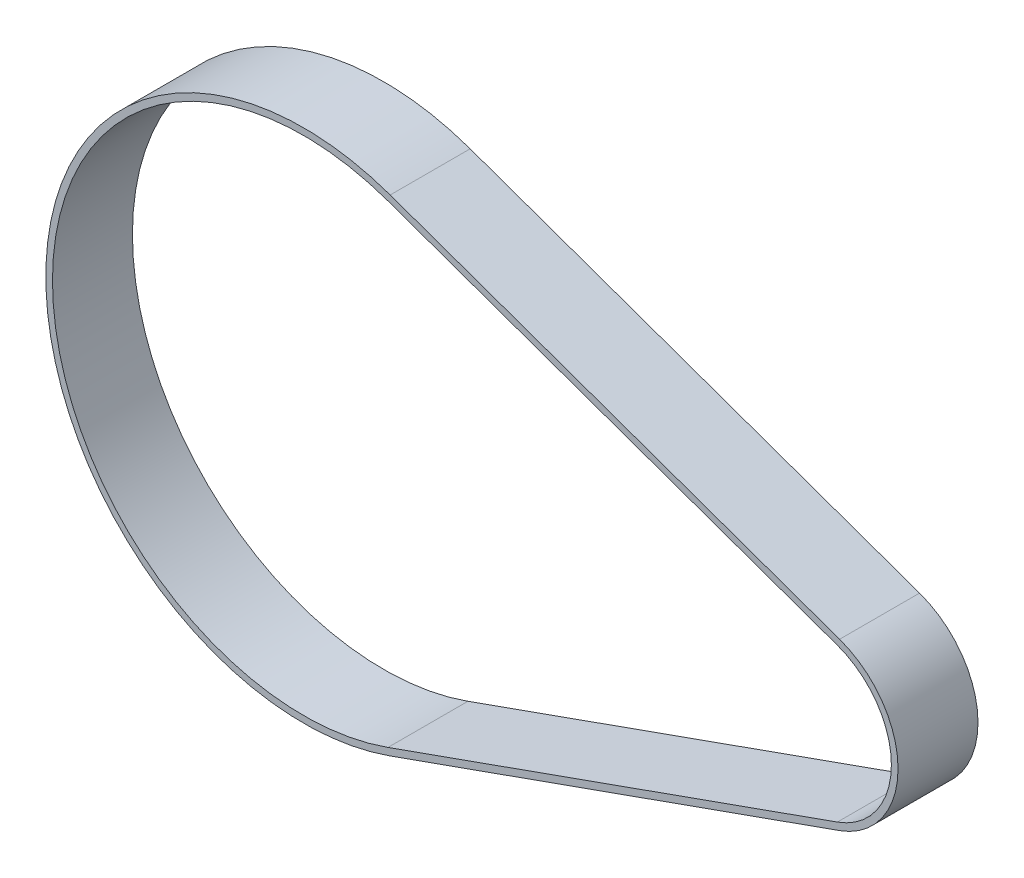
ISO-10303-21;
HEADER;
FILE_DESCRIPTION(('STEP AP214'),'2;1');
FILE_NAME('part.step','',(''),(''),'','','');
FILE_SCHEMA(('AUTOMOTIVE_DESIGN { 1 0 10303 214 1 1 1 1 }'));
ENDSEC;
DATA;
#1=APPLICATION_CONTEXT('core data for automotive mechanical design processes');
#2=APPLICATION_PROTOCOL_DEFINITION('international standard','automotive_design',2000,#1);
#3=PRODUCT_CONTEXT('',#1,'mechanical');
#4=PRODUCT('Part','Part','',(#3));
#5=PRODUCT_RELATED_PRODUCT_CATEGORY('part','',(#4));
#6=PRODUCT_DEFINITION_FORMATION('','',#4);
#7=PRODUCT_DEFINITION_CONTEXT('part definition',#1,'design');
#8=PRODUCT_DEFINITION('design','',#6,#7);
#9=PRODUCT_DEFINITION_SHAPE('','',#8);
#10=(LENGTH_UNIT() NAMED_UNIT(*) SI_UNIT(.MILLI.,.METRE.));
#11=(NAMED_UNIT(*) PLANE_ANGLE_UNIT() SI_UNIT($,.RADIAN.));
#12=(NAMED_UNIT(*) SI_UNIT($,.STERADIAN.) SOLID_ANGLE_UNIT());
#13=UNCERTAINTY_MEASURE_WITH_UNIT(LENGTH_MEASURE(1.E-05),#10,'distance_accuracy_value','');
#14=(GEOMETRIC_REPRESENTATION_CONTEXT(3) GLOBAL_UNCERTAINTY_ASSIGNED_CONTEXT((#13)) GLOBAL_UNIT_ASSIGNED_CONTEXT((#10,
#11,#12)) REPRESENTATION_CONTEXT('',''));
#15=CARTESIAN_POINT('',(0.,0.,0.));
#16=DIRECTION('',(0.,0.,1.));
#17=DIRECTION('',(1.,0.,0.));
#18=AXIS2_PLACEMENT_3D('',#15,#16,#17);
#19=CARTESIAN_POINT('',(0.,0.,6.));
#20=DIRECTION('',(0.,0.,1.));
#21=DIRECTION('',(1.,0.,0.));
#22=AXIS2_PLACEMENT_3D('',#19,#20,#21);
#23=PLANE('',#22);
#24=CARTESIAN_POINT('',(0.,0.,6.));
#25=DIRECTION('',(0.,0.,1.));
#26=DIRECTION('',(1.,0.,0.));
#27=AXIS2_PLACEMENT_3D('',#24,#25,#26);
#28=CIRCLE('',#27,19.35);
#29=CARTESIAN_POINT('',(6.49243421052632,18.2282966297454,6.));
#30=VERTEX_POINT('',#29);
#31=CARTESIAN_POINT('',(6.49243421052631,-18.2282966297454,6.));
#32=VERTEX_POINT('',#31);
#33=EDGE_CURVE('E133',#30,#32,#28,.T.);
#34=ORIENTED_EDGE('',*,*,#33,.T.);
#35=DIRECTION('',(0.942030833578574,0.335526315789474,0.));
#36=VECTOR('',#35,1.);
#37=CARTESIAN_POINT('',(40.2144736842105,-6.21740350161858,6.));
#38=LINE('',#37,#36);
#39=CARTESIAN_POINT('',(40.2144736842105,-6.21740350161858,6.));
#40=VERTEX_POINT('',#39);
#41=EDGE_CURVE('E136',#32,#40,#38,.T.);
#42=ORIENTED_EDGE('',*,*,#41,.T.);
#43=CARTESIAN_POINT('',(38.,0.,6.));
#44=DIRECTION('',(0.,0.,1.));
#45=DIRECTION('',(1.,0.,0.));
#46=AXIS2_PLACEMENT_3D('',#43,#44,#45);
#47=CIRCLE('',#46,6.6);
#48=CARTESIAN_POINT('',(40.2144736842105,6.21740350161858,6.));
#49=VERTEX_POINT('',#48);
#50=EDGE_CURVE('E139',#40,#49,#47,.T.);
#51=ORIENTED_EDGE('',*,*,#50,.T.);
#52=DIRECTION('',(-0.942030833578574,0.335526315789474,0.));
#53=VECTOR('',#52,1.);
#54=CARTESIAN_POINT('',(6.49243421052632,18.2282966297454,6.));
#55=LINE('',#54,#53);
#56=EDGE_CURVE('E141',#49,#30,#55,.T.);
#57=ORIENTED_EDGE('',*,*,#56,.T.);
#58=EDGE_LOOP('',(#34,#42,#51,#57));
#59=FACE_BOUND('',#58,.T.);
#60=DIRECTION('',(0.942030833578574,0.335526315789474,0.));
#61=VECTOR('',#60,1.);
#62=CARTESIAN_POINT('',(40.0467105263158,-5.7463880848293,6.));
#63=LINE('',#62,#61);
#64=CARTESIAN_POINT('',(6.32467105263158,-17.7572812129561,6.));
#65=VERTEX_POINT('',#64);
#66=CARTESIAN_POINT('',(40.0467105263158,-5.7463880848293,6.));
#67=VERTEX_POINT('',#66);
#68=EDGE_CURVE('E105',#65,#67,#63,.T.);
#69=ORIENTED_EDGE('',*,*,#68,.F.);
#70=CARTESIAN_POINT('',(0.,0.,6.));
#71=DIRECTION('',(0.,0.,1.));
#72=DIRECTION('',(1.,0.,0.));
#73=AXIS2_PLACEMENT_3D('',#70,#71,#72);
#74=CIRCLE('',#73,18.85);
#75=CARTESIAN_POINT('',(6.32467105263158,17.7572812129561,6.));
#76=VERTEX_POINT('',#75);
#77=EDGE_CURVE('E97',#76,#65,#74,.T.);
#78=ORIENTED_EDGE('',*,*,#77,.F.);
#79=DIRECTION('',(-0.942030833578574,0.335526315789474,0.));
#80=VECTOR('',#79,1.);
#81=CARTESIAN_POINT('',(6.32467105263158,17.7572812129561,6.));
#82=LINE('',#81,#80);
#83=CARTESIAN_POINT('',(40.0467105263158,5.7463880848293,6.));
#84=VERTEX_POINT('',#83);
#85=EDGE_CURVE('E119',#84,#76,#82,.T.);
#86=ORIENTED_EDGE('',*,*,#85,.F.);
#87=CARTESIAN_POINT('',(38.,0.,6.));
#88=DIRECTION('',(0.,0.,1.));
#89=DIRECTION('',(1.,0.,0.));
#90=AXIS2_PLACEMENT_3D('',#87,#88,#89);
#91=CIRCLE('',#90,6.1);
#92=EDGE_CURVE('E117',#67,#84,#91,.T.);
#93=ORIENTED_EDGE('',*,*,#92,.F.);
#94=EDGE_LOOP('',(#69,#78,#86,#93));
#95=FACE_BOUND('',#94,.T.);
#96=ADVANCED_FACE('F32',(#59,#95),#23,.T.);
#97=CARTESIAN_POINT('',(0.,0.,0.));
#98=DIRECTION('',(0.,0.,1.));
#99=DIRECTION('',(1.,0.,0.));
#100=AXIS2_PLACEMENT_3D('',#97,#98,#99);
#101=PLANE('',#100);
#102=CARTESIAN_POINT('',(0.,0.,0.));
#103=DIRECTION('',(0.,0.,1.));
#104=DIRECTION('',(1.,0.,0.));
#105=AXIS2_PLACEMENT_3D('',#102,#103,#104);
#106=CIRCLE('',#105,19.35);
#107=CARTESIAN_POINT('',(6.49243421052632,18.2282966297454,0.));
#108=VERTEX_POINT('',#107);
#109=CARTESIAN_POINT('',(6.49243421052631,-18.2282966297454,0.));
#110=VERTEX_POINT('',#109);
#111=EDGE_CURVE('E113',#108,#110,#106,.T.);
#112=ORIENTED_EDGE('',*,*,#111,.F.);
#113=DIRECTION('',(-0.942030833578574,0.335526315789474,0.));
#114=VECTOR('',#113,1.);
#115=CARTESIAN_POINT('',(6.49243421052632,18.2282966297454,0.));
#116=LINE('',#115,#114);
#117=CARTESIAN_POINT('',(40.2144736842105,6.21740350161858,0.));
#118=VERTEX_POINT('',#117);
#119=EDGE_CURVE('E137',#118,#108,#116,.T.);
#120=ORIENTED_EDGE('',*,*,#119,.F.);
#121=CARTESIAN_POINT('',(38.,0.,0.));
#122=DIRECTION('',(0.,0.,1.));
#123=DIRECTION('',(1.,0.,0.));
#124=AXIS2_PLACEMENT_3D('',#121,#122,#123);
#125=CIRCLE('',#124,6.6);
#126=CARTESIAN_POINT('',(40.2144736842105,-6.21740350161858,0.));
#127=VERTEX_POINT('',#126);
#128=EDGE_CURVE('E148',#127,#118,#125,.T.);
#129=ORIENTED_EDGE('',*,*,#128,.F.);
#130=DIRECTION('',(0.942030833578574,0.335526315789474,0.));
#131=VECTOR('',#130,1.);
#132=CARTESIAN_POINT('',(40.2144736842105,-6.21740350161858,0.));
#133=LINE('',#132,#131);
#134=EDGE_CURVE('E146',#110,#127,#133,.T.);
#135=ORIENTED_EDGE('',*,*,#134,.F.);
#136=EDGE_LOOP('',(#112,#120,#129,#135));
#137=FACE_BOUND('',#136,.T.);
#138=CARTESIAN_POINT('',(0.,0.,0.));
#139=DIRECTION('',(0.,0.,1.));
#140=DIRECTION('',(1.,0.,0.));
#141=AXIS2_PLACEMENT_3D('',#138,#139,#140);
#142=CIRCLE('',#141,18.85);
#143=CARTESIAN_POINT('',(6.32467105263158,17.7572812129561,0.));
#144=VERTEX_POINT('',#143);
#145=CARTESIAN_POINT('',(6.32467105263158,-17.7572812129561,0.));
#146=VERTEX_POINT('',#145);
#147=EDGE_CURVE('E55',#144,#146,#142,.T.);
#148=ORIENTED_EDGE('',*,*,#147,.T.);
#149=DIRECTION('',(0.942030833578574,0.335526315789474,0.));
#150=VECTOR('',#149,1.);
#151=CARTESIAN_POINT('',(40.0467105263158,-5.7463880848293,0.));
#152=LINE('',#151,#150);
#153=CARTESIAN_POINT('',(40.0467105263158,-5.7463880848293,0.));
#154=VERTEX_POINT('',#153);
#155=EDGE_CURVE('E112',#146,#154,#152,.T.);
#156=ORIENTED_EDGE('',*,*,#155,.T.);
#157=CARTESIAN_POINT('',(38.,0.,0.));
#158=DIRECTION('',(0.,0.,1.));
#159=DIRECTION('',(1.,0.,0.));
#160=AXIS2_PLACEMENT_3D('',#157,#158,#159);
#161=CIRCLE('',#160,6.1);
#162=CARTESIAN_POINT('',(40.0467105263158,5.7463880848293,0.));
#163=VERTEX_POINT('',#162);
#164=EDGE_CURVE('E125',#154,#163,#161,.T.);
#165=ORIENTED_EDGE('',*,*,#164,.T.);
#166=DIRECTION('',(-0.942030833578574,0.335526315789474,0.));
#167=VECTOR('',#166,1.);
#168=CARTESIAN_POINT('',(6.32467105263158,17.7572812129561,0.));
#169=LINE('',#168,#167);
#170=EDGE_CURVE('E106',#163,#144,#169,.T.);
#171=ORIENTED_EDGE('',*,*,#170,.T.);
#172=EDGE_LOOP('',(#148,#156,#165,#171));
#173=FACE_BOUND('',#172,.T.);
#174=ADVANCED_FACE('F166',(#137,#173),#101,.F.);
#175=CARTESIAN_POINT('',(0.,0.,6.));
#176=DIRECTION('',(0.,0.,-1.));
#177=DIRECTION('',(-1.,0.,0.));
#178=AXIS2_PLACEMENT_3D('',#175,#176,#177);
#179=CYLINDRICAL_SURFACE('',#178,19.35);
#180=ORIENTED_EDGE('',*,*,#111,.T.);
#181=DIRECTION('',(0.,0.,-1.));
#182=VECTOR('',#181,1.);
#183=CARTESIAN_POINT('',(6.49243421052631,-18.2282966297454,6.));
#184=LINE('',#183,#182);
#185=EDGE_CURVE('E11',#32,#110,#184,.T.);
#186=ORIENTED_EDGE('',*,*,#185,.F.);
#187=ORIENTED_EDGE('',*,*,#33,.F.);
#188=DIRECTION('',(0.,0.,-1.));
#189=VECTOR('',#188,1.);
#190=CARTESIAN_POINT('',(6.49243421052632,18.2282966297454,6.));
#191=LINE('',#190,#189);
#192=EDGE_CURVE('E143',#30,#108,#191,.T.);
#193=ORIENTED_EDGE('',*,*,#192,.T.);
#194=EDGE_LOOP('',(#180,#186,#187,#193));
#195=FACE_BOUND('',#194,.T.);
#196=ADVANCED_FACE('F34',(#195),#179,.T.);
#197=CARTESIAN_POINT('',(40.2144736842105,-6.21740350161858,6.));
#198=DIRECTION('',(-0.335526315789474,0.942030833578574,0.));
#199=DIRECTION('',(-0.942030833578574,-0.335526315789474,0.));
#200=AXIS2_PLACEMENT_3D('',#197,#198,#199);
#201=PLANE('',#200);
#202=ORIENTED_EDGE('',*,*,#134,.T.);
#203=DIRECTION('',(0.,0.,-1.));
#204=VECTOR('',#203,1.);
#205=CARTESIAN_POINT('',(40.2144736842105,-6.21740350161858,6.));
#206=LINE('',#205,#204);
#207=EDGE_CURVE('E40',#40,#127,#206,.T.);
#208=ORIENTED_EDGE('',*,*,#207,.F.);
#209=ORIENTED_EDGE('',*,*,#41,.F.);
#210=ORIENTED_EDGE('',*,*,#185,.T.);
#211=EDGE_LOOP('',(#202,#208,#209,#210));
#212=FACE_BOUND('',#211,.T.);
#213=ADVANCED_FACE('F176',(#212),#201,.F.);
#214=CARTESIAN_POINT('',(38.,0.,6.));
#215=DIRECTION('',(0.,0.,-1.));
#216=DIRECTION('',(-1.,0.,0.));
#217=AXIS2_PLACEMENT_3D('',#214,#215,#216);
#218=CYLINDRICAL_SURFACE('',#217,6.6);
#219=ORIENTED_EDGE('',*,*,#128,.T.);
#220=DIRECTION('',(0.,0.,-1.));
#221=VECTOR('',#220,1.);
#222=CARTESIAN_POINT('',(40.2144736842105,6.21740350161858,6.));
#223=LINE('',#222,#221);
#224=EDGE_CURVE('E153',#49,#118,#223,.T.);
#225=ORIENTED_EDGE('',*,*,#224,.F.);
#226=ORIENTED_EDGE('',*,*,#50,.F.);
#227=ORIENTED_EDGE('',*,*,#207,.T.);
#228=EDGE_LOOP('',(#219,#225,#226,#227));
#229=FACE_BOUND('',#228,.T.);
#230=ADVANCED_FACE('F160',(#229),#218,.T.);
#231=CARTESIAN_POINT('',(6.49243421052632,18.2282966297454,6.));
#232=DIRECTION('',(-0.335526315789474,-0.942030833578574,0.));
#233=DIRECTION('',(0.942030833578574,-0.335526315789474,0.));
#234=AXIS2_PLACEMENT_3D('',#231,#232,#233);
#235=PLANE('',#234);
#236=ORIENTED_EDGE('',*,*,#119,.T.);
#237=ORIENTED_EDGE('',*,*,#192,.F.);
#238=ORIENTED_EDGE('',*,*,#56,.F.);
#239=ORIENTED_EDGE('',*,*,#224,.T.);
#240=EDGE_LOOP('',(#236,#237,#238,#239));
#241=FACE_BOUND('',#240,.T.);
#242=ADVANCED_FACE('F170',(#241),#235,.F.);
#243=CARTESIAN_POINT('',(0.,0.,6.));
#244=DIRECTION('',(0.,0.,-1.));
#245=DIRECTION('',(-1.,0.,0.));
#246=AXIS2_PLACEMENT_3D('',#243,#244,#245);
#247=CYLINDRICAL_SURFACE('',#246,18.85);
#248=ORIENTED_EDGE('',*,*,#147,.F.);
#249=DIRECTION('',(0.,0.,-1.));
#250=VECTOR('',#249,1.);
#251=CARTESIAN_POINT('',(6.32467105263158,17.7572812129561,6.));
#252=LINE('',#251,#250);
#253=EDGE_CURVE('E101',#76,#144,#252,.T.);
#254=ORIENTED_EDGE('',*,*,#253,.F.);
#255=ORIENTED_EDGE('',*,*,#77,.T.);
#256=DIRECTION('',(0.,0.,-1.));
#257=VECTOR('',#256,1.);
#258=CARTESIAN_POINT('',(6.32467105263158,-17.7572812129561,6.));
#259=LINE('',#258,#257);
#260=EDGE_CURVE('E100',#65,#146,#259,.T.);
#261=ORIENTED_EDGE('',*,*,#260,.T.);
#262=EDGE_LOOP('',(#248,#254,#255,#261));
#263=FACE_BOUND('',#262,.T.);
#264=ADVANCED_FACE('F99',(#263),#247,.F.);
#265=CARTESIAN_POINT('',(40.0467105263158,-5.7463880848293,6.));
#266=DIRECTION('',(-0.335526315789474,0.942030833578574,0.));
#267=DIRECTION('',(-0.942030833578574,-0.335526315789474,0.));
#268=AXIS2_PLACEMENT_3D('',#265,#266,#267);
#269=PLANE('',#268);
#270=ORIENTED_EDGE('',*,*,#155,.F.);
#271=ORIENTED_EDGE('',*,*,#260,.F.);
#272=ORIENTED_EDGE('',*,*,#68,.T.);
#273=DIRECTION('',(0.,0.,-1.));
#274=VECTOR('',#273,1.);
#275=CARTESIAN_POINT('',(40.0467105263158,-5.7463880848293,6.));
#276=LINE('',#275,#274);
#277=EDGE_CURVE('E114',#67,#154,#276,.T.);
#278=ORIENTED_EDGE('',*,*,#277,.T.);
#279=EDGE_LOOP('',(#270,#271,#272,#278));
#280=FACE_BOUND('',#279,.T.);
#281=ADVANCED_FACE('F109',(#280),#269,.T.);
#282=CARTESIAN_POINT('',(38.,0.,6.));
#283=DIRECTION('',(0.,0.,-1.));
#284=DIRECTION('',(-1.,0.,0.));
#285=AXIS2_PLACEMENT_3D('',#282,#283,#284);
#286=CYLINDRICAL_SURFACE('',#285,6.1);
#287=ORIENTED_EDGE('',*,*,#164,.F.);
#288=ORIENTED_EDGE('',*,*,#277,.F.);
#289=ORIENTED_EDGE('',*,*,#92,.T.);
#290=DIRECTION('',(0.,0.,-1.));
#291=VECTOR('',#290,1.);
#292=CARTESIAN_POINT('',(40.0467105263158,5.7463880848293,6.));
#293=LINE('',#292,#291);
#294=EDGE_CURVE('E47',#84,#163,#293,.T.);
#295=ORIENTED_EDGE('',*,*,#294,.T.);
#296=EDGE_LOOP('',(#287,#288,#289,#295));
#297=FACE_BOUND('',#296,.T.);
#298=ADVANCED_FACE('F199',(#297),#286,.F.);
#299=CARTESIAN_POINT('',(6.32467105263158,17.7572812129561,6.));
#300=DIRECTION('',(-0.335526315789474,-0.942030833578574,0.));
#301=DIRECTION('',(0.942030833578574,-0.335526315789474,0.));
#302=AXIS2_PLACEMENT_3D('',#299,#300,#301);
#303=PLANE('',#302);
#304=ORIENTED_EDGE('',*,*,#170,.F.);
#305=ORIENTED_EDGE('',*,*,#294,.F.);
#306=ORIENTED_EDGE('',*,*,#85,.T.);
#307=ORIENTED_EDGE('',*,*,#253,.T.);
#308=EDGE_LOOP('',(#304,#305,#306,#307));
#309=FACE_BOUND('',#308,.T.);
#310=ADVANCED_FACE('F203',(#309),#303,.T.);
#311=CLOSED_SHELL('',(#96,#174,#196,#213,#230,#242,#264,#281,#298,#310));
#312=MANIFOLD_SOLID_BREP('B2',#311);
#313=ADVANCED_BREP_SHAPE_REPRESENTATION('',(#18,#312),#14);
#314=SHAPE_DEFINITION_REPRESENTATION(#9,#313);
ENDSEC;
END-ISO-10303-21;
